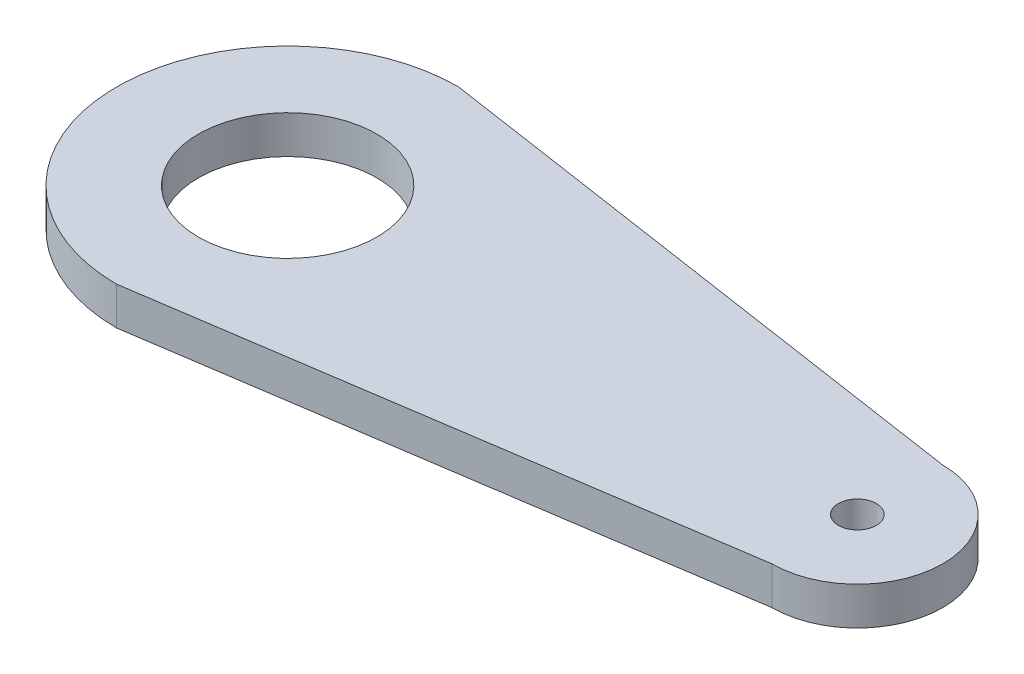
ISO-10303-21;
HEADER;
FILE_DESCRIPTION(('STEP AP214'),'2;1');
FILE_NAME('part.step','',(''),(''),'','','');
FILE_SCHEMA(('AUTOMOTIVE_DESIGN { 1 0 10303 214 1 1 1 1 }'));
ENDSEC;
DATA;
#1=APPLICATION_CONTEXT('core data for automotive mechanical design processes');
#2=APPLICATION_PROTOCOL_DEFINITION('international standard','automotive_design',2000,#1);
#3=PRODUCT_CONTEXT('',#1,'mechanical');
#4=PRODUCT('Part','Part','',(#3));
#5=PRODUCT_RELATED_PRODUCT_CATEGORY('part','',(#4));
#6=PRODUCT_DEFINITION_FORMATION('','',#4);
#7=PRODUCT_DEFINITION_CONTEXT('part definition',#1,'design');
#8=PRODUCT_DEFINITION('design','',#6,#7);
#9=PRODUCT_DEFINITION_SHAPE('','',#8);
#10=(LENGTH_UNIT() NAMED_UNIT(*) SI_UNIT(.MILLI.,.METRE.));
#11=(NAMED_UNIT(*) PLANE_ANGLE_UNIT() SI_UNIT($,.RADIAN.));
#12=(NAMED_UNIT(*) SI_UNIT($,.STERADIAN.) SOLID_ANGLE_UNIT());
#13=UNCERTAINTY_MEASURE_WITH_UNIT(LENGTH_MEASURE(1.E-05),#10,'distance_accuracy_value','');
#14=(GEOMETRIC_REPRESENTATION_CONTEXT(3) GLOBAL_UNCERTAINTY_ASSIGNED_CONTEXT((#13)) GLOBAL_UNIT_ASSIGNED_CONTEXT((#10,
#11,#12)) REPRESENTATION_CONTEXT('',''));
#15=CARTESIAN_POINT('',(0.,0.,0.));
#16=DIRECTION('',(0.,0.,1.));
#17=DIRECTION('',(1.,0.,0.));
#18=AXIS2_PLACEMENT_3D('',#15,#16,#17);
#19=CARTESIAN_POINT('',(0.660146699266504,1.,4.40097799511002));
#20=DIRECTION('',(-0.148340452930245,0.,-0.988936352868298));
#21=DIRECTION('',(-0.988936352868298,0.,0.148340452930245));
#22=AXIS2_PLACEMENT_3D('',#19,#20,#21);
#23=PLANE('',#22);
#24=DIRECTION('',(0.988936352868298,0.,-0.148340452930245));
#25=VECTOR('',#24,1.);
#26=CARTESIAN_POINT('',(0.660146699266504,0.,4.40097799511002));
#27=LINE('',#26,#25);
#28=CARTESIAN_POINT('',(0.,0.,4.5));
#29=VERTEX_POINT('',#28);
#30=CARTESIAN_POINT('',(15.,0.,2.25));
#31=VERTEX_POINT('',#30);
#32=EDGE_CURVE('E101',#29,#31,#27,.T.);
#33=ORIENTED_EDGE('',*,*,#32,.T.);
#34=DIRECTION('',(0.,-1.,0.));
#35=VECTOR('',#34,1.);
#36=CARTESIAN_POINT('',(15.,1.,2.25));
#37=LINE('',#36,#35);
#38=CARTESIAN_POINT('',(15.,1.,2.25));
#39=VERTEX_POINT('',#38);
#40=EDGE_CURVE('E11',#39,#31,#37,.T.);
#41=ORIENTED_EDGE('',*,*,#40,.F.);
#42=DIRECTION('',(0.988936352868298,0.,-0.148340452930245));
#43=VECTOR('',#42,1.);
#44=CARTESIAN_POINT('',(0.660146699266504,1.,4.40097799511002));
#45=LINE('',#44,#43);
#46=CARTESIAN_POINT('',(0.,1.,4.5));
#47=VERTEX_POINT('',#46);
#48=EDGE_CURVE('E80',#47,#39,#45,.T.);
#49=ORIENTED_EDGE('',*,*,#48,.F.);
#50=DIRECTION('',(0.,-1.,0.));
#51=VECTOR('',#50,1.);
#52=CARTESIAN_POINT('',(0.,1.,4.5));
#53=LINE('',#52,#51);
#54=EDGE_CURVE('E91',#47,#29,#53,.T.);
#55=ORIENTED_EDGE('',*,*,#54,.T.);
#56=EDGE_LOOP('',(#33,#41,#49,#55));
#57=FACE_BOUND('',#56,.T.);
#58=ADVANCED_FACE('F32',(#57),#23,.F.);
#59=CARTESIAN_POINT('',(15.,1.,0.));
#60=DIRECTION('',(0.,-1.,0.));
#61=DIRECTION('',(0.,0.,-1.));
#62=AXIS2_PLACEMENT_3D('',#59,#60,#61);
#63=CYLINDRICAL_SURFACE('',#62,2.25);
#64=CARTESIAN_POINT('',(15.,0.,0.));
#65=DIRECTION('',(0.,1.,0.));
#66=DIRECTION('',(0.,0.,1.));
#67=AXIS2_PLACEMENT_3D('',#64,#65,#66);
#68=CIRCLE('',#67,2.25);
#69=CARTESIAN_POINT('',(15.,0.,-2.25));
#70=VERTEX_POINT('',#69);
#71=EDGE_CURVE('E85',#31,#70,#68,.T.);
#72=ORIENTED_EDGE('',*,*,#71,.T.);
#73=DIRECTION('',(0.,-1.,0.));
#74=VECTOR('',#73,1.);
#75=CARTESIAN_POINT('',(15.,1.,-2.25));
#76=LINE('',#75,#74);
#77=CARTESIAN_POINT('',(15.,1.,-2.25));
#78=VERTEX_POINT('',#77);
#79=EDGE_CURVE('E41',#78,#70,#76,.T.);
#80=ORIENTED_EDGE('',*,*,#79,.F.);
#81=CARTESIAN_POINT('',(15.,1.,0.));
#82=DIRECTION('',(0.,1.,0.));
#83=DIRECTION('',(0.,0.,1.));
#84=AXIS2_PLACEMENT_3D('',#81,#82,#83);
#85=CIRCLE('',#84,2.25);
#86=EDGE_CURVE('E75',#39,#78,#85,.T.);
#87=ORIENTED_EDGE('',*,*,#86,.F.);
#88=ORIENTED_EDGE('',*,*,#40,.T.);
#89=EDGE_LOOP('',(#72,#80,#87,#88));
#90=FACE_BOUND('',#89,.T.);
#91=ADVANCED_FACE('F84',(#90),#63,.T.);
#92=CARTESIAN_POINT('',(0.660146699266504,1.,-4.40097799511002));
#93=DIRECTION('',(0.148340452930245,0.,-0.988936352868298));
#94=DIRECTION('',(-0.988936352868298,0.,-0.148340452930245));
#95=AXIS2_PLACEMENT_3D('',#92,#93,#94);
#96=PLANE('',#95);
#97=DIRECTION('',(0.988936352868298,0.,0.148340452930245));
#98=VECTOR('',#97,1.);
#99=CARTESIAN_POINT('',(0.660146699266504,0.,-4.40097799511002));
#100=LINE('',#99,#98);
#101=CARTESIAN_POINT('',(0.,0.,-4.5));
#102=VERTEX_POINT('',#101);
#103=EDGE_CURVE('E105',#102,#70,#100,.T.);
#104=ORIENTED_EDGE('',*,*,#103,.F.);
#105=DIRECTION('',(0.,-1.,0.));
#106=VECTOR('',#105,1.);
#107=CARTESIAN_POINT('',(0.,1.,-4.5));
#108=LINE('',#107,#106);
#109=CARTESIAN_POINT('',(0.,1.,-4.5));
#110=VERTEX_POINT('',#109);
#111=EDGE_CURVE('E65',#110,#102,#108,.T.);
#112=ORIENTED_EDGE('',*,*,#111,.F.);
#113=DIRECTION('',(0.988936352868298,0.,0.148340452930245));
#114=VECTOR('',#113,1.);
#115=CARTESIAN_POINT('',(0.660146699266504,1.,-4.40097799511002));
#116=LINE('',#115,#114);
#117=EDGE_CURVE('E78',#110,#78,#116,.T.);
#118=ORIENTED_EDGE('',*,*,#117,.T.);
#119=ORIENTED_EDGE('',*,*,#79,.T.);
#120=EDGE_LOOP('',(#104,#112,#118,#119));
#121=FACE_BOUND('',#120,.T.);
#122=ADVANCED_FACE('F89',(#121),#96,.T.);
#123=CARTESIAN_POINT('',(0.,1.,0.));
#124=DIRECTION('',(0.,-1.,0.));
#125=DIRECTION('',(0.,0.,-1.));
#126=AXIS2_PLACEMENT_3D('',#123,#124,#125);
#127=CYLINDRICAL_SURFACE('',#126,2.35);
#128=CARTESIAN_POINT('',(0.,1.,0.));
#129=DIRECTION('',(0.,1.,0.));
#130=DIRECTION('',(0.,0.,1.));
#131=AXIS2_PLACEMENT_3D('',#128,#129,#130);
#132=CIRCLE('',#131,2.35);
#133=CARTESIAN_POINT('',(0.,1.,2.35));
#134=VERTEX_POINT('',#133);
#135=EDGE_CURVE('E143',#134,#134,#132,.T.);
#136=ORIENTED_EDGE('',*,*,#135,.T.);
#137=EDGE_LOOP('',(#136));
#138=FACE_BOUND('',#137,.T.);
#139=CARTESIAN_POINT('',(0.,0.,0.));
#140=DIRECTION('',(0.,1.,0.));
#141=DIRECTION('',(0.,0.,1.));
#142=AXIS2_PLACEMENT_3D('',#139,#140,#141);
#143=CIRCLE('',#142,2.35);
#144=CARTESIAN_POINT('',(0.,0.,2.35));
#145=VERTEX_POINT('',#144);
#146=EDGE_CURVE('E98',#145,#145,#143,.T.);
#147=ORIENTED_EDGE('',*,*,#146,.F.);
#148=EDGE_LOOP('',(#147));
#149=FACE_BOUND('',#148,.T.);
#150=ADVANCED_FACE('F132',(#138,#149),#127,.F.);
#151=CARTESIAN_POINT('',(15.,1.,0.));
#152=DIRECTION('',(0.,-1.,0.));
#153=DIRECTION('',(0.,0.,-1.));
#154=AXIS2_PLACEMENT_3D('',#151,#152,#153);
#155=CYLINDRICAL_SURFACE('',#154,0.500000000000001);
#156=CARTESIAN_POINT('',(15.,1.,0.));
#157=DIRECTION('',(0.,1.,0.));
#158=DIRECTION('',(0.,0.,1.));
#159=AXIS2_PLACEMENT_3D('',#156,#157,#158);
#160=CIRCLE('',#159,0.500000000000001);
#161=CARTESIAN_POINT('',(15.,1.,0.500000000000001));
#162=VERTEX_POINT('',#161);
#163=EDGE_CURVE('E108',#162,#162,#160,.T.);
#164=ORIENTED_EDGE('',*,*,#163,.T.);
#165=EDGE_LOOP('',(#164));
#166=FACE_BOUND('',#165,.T.);
#167=CARTESIAN_POINT('',(15.,0.,0.));
#168=DIRECTION('',(0.,1.,0.));
#169=DIRECTION('',(0.,0.,1.));
#170=AXIS2_PLACEMENT_3D('',#167,#168,#169);
#171=CIRCLE('',#170,0.500000000000001);
#172=CARTESIAN_POINT('',(15.,0.,0.500000000000001));
#173=VERTEX_POINT('',#172);
#174=EDGE_CURVE('E95',#173,#173,#171,.T.);
#175=ORIENTED_EDGE('',*,*,#174,.F.);
#176=EDGE_LOOP('',(#175));
#177=FACE_BOUND('',#176,.T.);
#178=ADVANCED_FACE('F34',(#166,#177),#155,.F.);
#179=CARTESIAN_POINT('',(0.,1.,0.));
#180=DIRECTION('',(0.,-1.,0.));
#181=DIRECTION('',(0.,0.,-1.));
#182=AXIS2_PLACEMENT_3D('',#179,#180,#181);
#183=CYLINDRICAL_SURFACE('',#182,4.5);
#184=CARTESIAN_POINT('',(0.,0.,0.));
#185=DIRECTION('',(0.,1.,0.));
#186=DIRECTION('',(0.,0.,1.));
#187=AXIS2_PLACEMENT_3D('',#184,#185,#186);
#188=CIRCLE('',#187,4.5);
#189=EDGE_CURVE('E68',#102,#29,#188,.T.);
#190=ORIENTED_EDGE('',*,*,#189,.T.);
#191=ORIENTED_EDGE('',*,*,#54,.F.);
#192=CARTESIAN_POINT('',(0.,1.,0.));
#193=DIRECTION('',(0.,1.,0.));
#194=DIRECTION('',(0.,0.,1.));
#195=AXIS2_PLACEMENT_3D('',#192,#193,#194);
#196=CIRCLE('',#195,4.5);
#197=EDGE_CURVE('E49',#110,#47,#196,.T.);
#198=ORIENTED_EDGE('',*,*,#197,.F.);
#199=ORIENTED_EDGE('',*,*,#111,.T.);
#200=EDGE_LOOP('',(#190,#191,#198,#199));
#201=FACE_BOUND('',#200,.T.);
#202=ADVANCED_FACE('F120',(#201),#183,.T.);
#203=CARTESIAN_POINT('',(0.,1.,0.));
#204=DIRECTION('',(0.,1.,0.));
#205=DIRECTION('',(0.,0.,1.));
#206=AXIS2_PLACEMENT_3D('',#203,#204,#205);
#207=PLANE('',#206);
#208=ORIENTED_EDGE('',*,*,#163,.F.);
#209=EDGE_LOOP('',(#208));
#210=FACE_BOUND('',#209,.T.);
#211=ORIENTED_EDGE('',*,*,#135,.F.);
#212=EDGE_LOOP('',(#211));
#213=FACE_BOUND('',#212,.T.);
#214=ORIENTED_EDGE('',*,*,#48,.T.);
#215=ORIENTED_EDGE('',*,*,#86,.T.);
#216=ORIENTED_EDGE('',*,*,#117,.F.);
#217=ORIENTED_EDGE('',*,*,#197,.T.);
#218=EDGE_LOOP('',(#214,#215,#216,#217));
#219=FACE_BOUND('',#218,.T.);
#220=ADVANCED_FACE('F76',(#210,#213,#219),#207,.T.);
#221=CARTESIAN_POINT('',(0.,0.,0.));
#222=DIRECTION('',(0.,1.,0.));
#223=DIRECTION('',(0.,0.,1.));
#224=AXIS2_PLACEMENT_3D('',#221,#222,#223);
#225=PLANE('',#224);
#226=ORIENTED_EDGE('',*,*,#174,.T.);
#227=EDGE_LOOP('',(#226));
#228=FACE_BOUND('',#227,.T.);
#229=ORIENTED_EDGE('',*,*,#146,.T.);
#230=EDGE_LOOP('',(#229));
#231=FACE_BOUND('',#230,.T.);
#232=ORIENTED_EDGE('',*,*,#32,.F.);
#233=ORIENTED_EDGE('',*,*,#189,.F.);
#234=ORIENTED_EDGE('',*,*,#103,.T.);
#235=ORIENTED_EDGE('',*,*,#71,.F.);
#236=EDGE_LOOP('',(#232,#233,#234,#235));
#237=FACE_BOUND('',#236,.T.);
#238=ADVANCED_FACE('F113',(#228,#231,#237),#225,.F.);
#239=CLOSED_SHELL('',(#58,#91,#122,#150,#178,#202,#220,#238));
#240=MANIFOLD_SOLID_BREP('B2',#239);
#241=ADVANCED_BREP_SHAPE_REPRESENTATION('',(#18,#240),#14);
#242=SHAPE_DEFINITION_REPRESENTATION(#9,#241);
ENDSEC;
END-ISO-10303-21;
